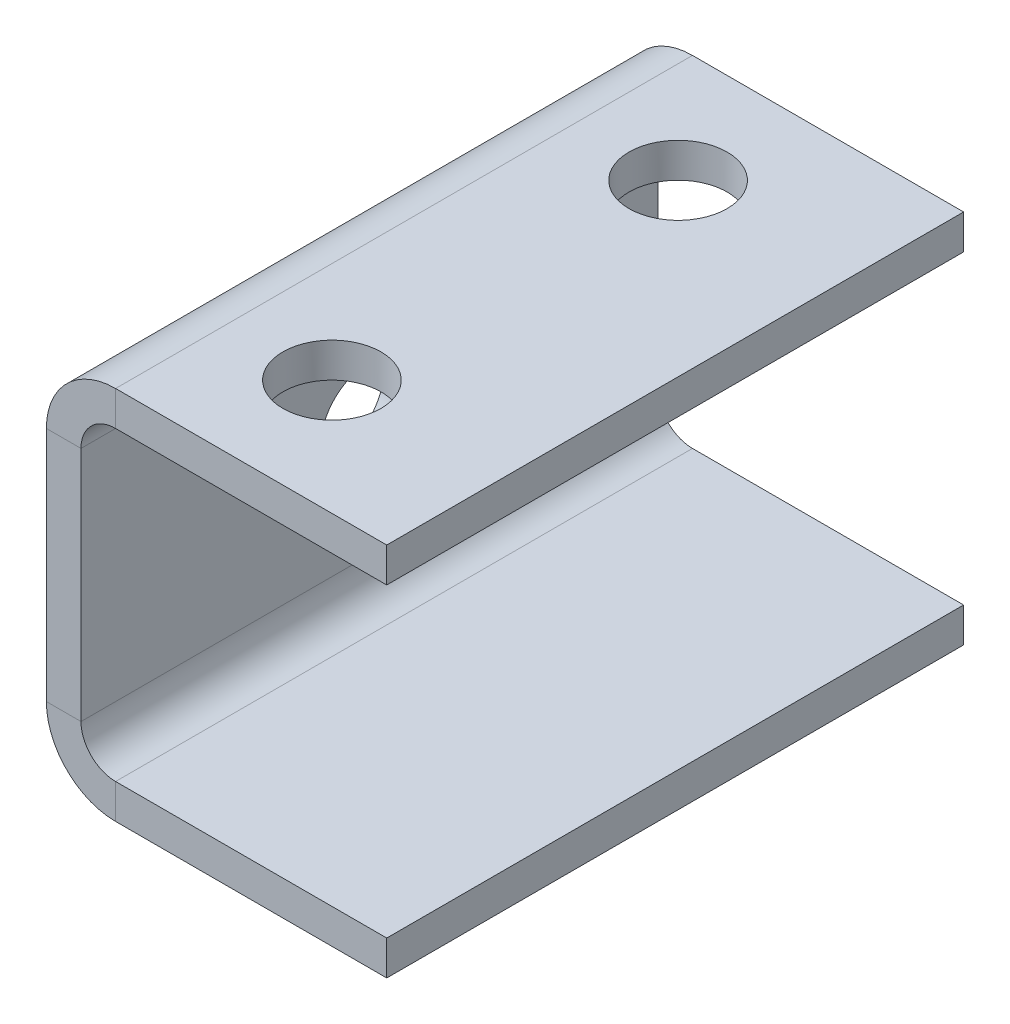
ISO-10303-21;
HEADER;
FILE_DESCRIPTION(('STEP AP214'),'2;1');
FILE_NAME('part.step','',(''),(''),'','','');
FILE_SCHEMA(('AUTOMOTIVE_DESIGN { 1 0 10303 214 1 1 1 1 }'));
ENDSEC;
DATA;
#1=APPLICATION_CONTEXT('core data for automotive mechanical design processes');
#2=APPLICATION_PROTOCOL_DEFINITION('international standard','automotive_design',2000,#1);
#3=PRODUCT_CONTEXT('',#1,'mechanical');
#4=PRODUCT('Part','Part','',(#3));
#5=PRODUCT_RELATED_PRODUCT_CATEGORY('part','',(#4));
#6=PRODUCT_DEFINITION_FORMATION('','',#4);
#7=PRODUCT_DEFINITION_CONTEXT('part definition',#1,'design');
#8=PRODUCT_DEFINITION('design','',#6,#7);
#9=PRODUCT_DEFINITION_SHAPE('','',#8);
#10=(LENGTH_UNIT() NAMED_UNIT(*) SI_UNIT(.MILLI.,.METRE.));
#11=(NAMED_UNIT(*) PLANE_ANGLE_UNIT() SI_UNIT($,.RADIAN.));
#12=(NAMED_UNIT(*) SI_UNIT($,.STERADIAN.) SOLID_ANGLE_UNIT());
#13=UNCERTAINTY_MEASURE_WITH_UNIT(LENGTH_MEASURE(1.E-05),#10,'distance_accuracy_value','');
#14=(GEOMETRIC_REPRESENTATION_CONTEXT(3) GLOBAL_UNCERTAINTY_ASSIGNED_CONTEXT((#13)) GLOBAL_UNIT_ASSIGNED_CONTEXT((#10,
#11,#12)) REPRESENTATION_CONTEXT('',''));
#15=CARTESIAN_POINT('',(0.,0.,0.));
#16=DIRECTION('',(0.,0.,1.));
#17=DIRECTION('',(1.,0.,0.));
#18=AXIS2_PLACEMENT_3D('',#15,#16,#17);
#19=CARTESIAN_POINT('',(6.00000000000001,-26.5,100.));
#20=DIRECTION('',(0.,0.,1.));
#21=DIRECTION('',(1.,0.,0.));
#22=AXIS2_PLACEMENT_3D('',#19,#20,#21);
#23=PLANE('',#22);
#24=DIRECTION('',(0.,-1.,0.));
#25=VECTOR('',#24,1.);
#26=CARTESIAN_POINT('',(6.00000000000001,-26.5,100.));
#27=LINE('',#26,#25);
#28=CARTESIAN_POINT('',(6.00000000000001,-26.5,100.));
#29=VERTEX_POINT('',#28);
#30=CARTESIAN_POINT('',(6.,-32.5,100.));
#31=VERTEX_POINT('',#30);
#32=EDGE_CURVE('E11',#29,#31,#27,.T.);
#33=ORIENTED_EDGE('',*,*,#32,.F.);
#34=CARTESIAN_POINT('',(6.00000000000001,-20.5,100.));
#35=DIRECTION('',(0.,0.,1.));
#36=DIRECTION('',(1.,0.,0.));
#37=AXIS2_PLACEMENT_3D('',#34,#35,#36);
#38=CIRCLE('',#37,6.);
#39=CARTESIAN_POINT('',(0.,-20.5,100.));
#40=VERTEX_POINT('',#39);
#41=EDGE_CURVE('E148',#29,#40,#38,.F.);
#42=ORIENTED_EDGE('',*,*,#41,.T.);
#43=DIRECTION('',(1.,0.,0.));
#44=VECTOR('',#43,1.);
#45=CARTESIAN_POINT('',(-5.99999999999999,-20.5,100.));
#46=LINE('',#45,#44);
#47=CARTESIAN_POINT('',(-5.99999999999999,-20.5,100.));
#48=VERTEX_POINT('',#47);
#49=EDGE_CURVE('E46',#48,#40,#46,.T.);
#50=ORIENTED_EDGE('',*,*,#49,.F.);
#51=CARTESIAN_POINT('',(6.00000000000001,-20.5,100.));
#52=DIRECTION('',(0.,0.,1.));
#53=DIRECTION('',(1.,0.,0.));
#54=AXIS2_PLACEMENT_3D('',#51,#52,#53);
#55=CIRCLE('',#54,12.);
#56=EDGE_CURVE('E243',#31,#48,#55,.F.);
#57=ORIENTED_EDGE('',*,*,#56,.F.);
#58=EDGE_LOOP('',(#33,#42,#50,#57));
#59=FACE_BOUND('',#58,.T.);
#60=ADVANCED_FACE('F38',(#59),#23,.T.);
#61=CARTESIAN_POINT('',(-5.99999999999999,-20.5,100.));
#62=DIRECTION('',(0.,0.,1.));
#63=DIRECTION('',(1.,0.,0.));
#64=AXIS2_PLACEMENT_3D('',#61,#62,#63);
#65=PLANE('',#64);
#66=DIRECTION('',(-1.,0.,0.));
#67=VECTOR('',#66,1.);
#68=CARTESIAN_POINT('',(0.,-26.5,100.));
#69=LINE('',#68,#67);
#70=CARTESIAN_POINT('',(53.,-26.5,100.));
#71=VERTEX_POINT('',#70);
#72=EDGE_CURVE('E153',#71,#29,#69,.T.);
#73=ORIENTED_EDGE('',*,*,#72,.T.);
#74=ORIENTED_EDGE('',*,*,#32,.T.);
#75=DIRECTION('',(1.,0.,0.));
#76=VECTOR('',#75,1.);
#77=CARTESIAN_POINT('',(0.,-32.5,100.));
#78=LINE('',#77,#76);
#79=CARTESIAN_POINT('',(53.,-32.5,100.));
#80=VERTEX_POINT('',#79);
#81=EDGE_CURVE('E256',#80,#31,#78,.F.);
#82=ORIENTED_EDGE('',*,*,#81,.F.);
#83=DIRECTION('',(0.,-1.,0.));
#84=VECTOR('',#83,1.);
#85=CARTESIAN_POINT('',(53.,-26.5,100.));
#86=LINE('',#85,#84);
#87=EDGE_CURVE('E258',#71,#80,#86,.T.);
#88=ORIENTED_EDGE('',*,*,#87,.F.);
#89=EDGE_LOOP('',(#73,#74,#82,#88));
#90=FACE_BOUND('',#89,.T.);
#91=ADVANCED_FACE('F269',(#90),#65,.T.);
#92=CARTESIAN_POINT('',(0.,-20.5,0.));
#93=DIRECTION('',(0.,0.,-1.));
#94=DIRECTION('',(-1.,0.,0.));
#95=AXIS2_PLACEMENT_3D('',#92,#93,#94);
#96=PLANE('',#95);
#97=DIRECTION('',(-1.,0.,0.));
#98=VECTOR('',#97,1.);
#99=CARTESIAN_POINT('',(0.,-20.5,0.));
#100=LINE('',#99,#98);
#101=CARTESIAN_POINT('',(0.,-20.5,0.));
#102=VERTEX_POINT('',#101);
#103=CARTESIAN_POINT('',(-5.99999999999999,-20.5,0.));
#104=VERTEX_POINT('',#103);
#105=EDGE_CURVE('E146',#102,#104,#100,.T.);
#106=ORIENTED_EDGE('',*,*,#105,.F.);
#107=CARTESIAN_POINT('',(6.00000000000001,-20.5,0.));
#108=DIRECTION('',(0.,0.,1.));
#109=DIRECTION('',(1.,0.,0.));
#110=AXIS2_PLACEMENT_3D('',#107,#108,#109);
#111=CIRCLE('',#110,6.);
#112=CARTESIAN_POINT('',(6.00000000000001,-26.5,0.));
#113=VERTEX_POINT('',#112);
#114=EDGE_CURVE('E160',#113,#102,#111,.F.);
#115=ORIENTED_EDGE('',*,*,#114,.F.);
#116=DIRECTION('',(0.,1.,0.));
#117=VECTOR('',#116,1.);
#118=CARTESIAN_POINT('',(6.,-32.5,0.));
#119=LINE('',#118,#117);
#120=CARTESIAN_POINT('',(6.,-32.5,0.));
#121=VERTEX_POINT('',#120);
#122=EDGE_CURVE('E234',#121,#113,#119,.T.);
#123=ORIENTED_EDGE('',*,*,#122,.F.);
#124=CARTESIAN_POINT('',(6.00000000000001,-20.5,0.));
#125=DIRECTION('',(0.,0.,1.));
#126=DIRECTION('',(1.,0.,0.));
#127=AXIS2_PLACEMENT_3D('',#124,#125,#126);
#128=CIRCLE('',#127,12.);
#129=EDGE_CURVE('E188',#121,#104,#128,.F.);
#130=ORIENTED_EDGE('',*,*,#129,.T.);
#131=EDGE_LOOP('',(#106,#115,#123,#130));
#132=FACE_BOUND('',#131,.T.);
#133=ADVANCED_FACE('F248',(#132),#96,.T.);
#134=CARTESIAN_POINT('',(6.,-32.5,0.));
#135=DIRECTION('',(0.,0.,-1.));
#136=DIRECTION('',(-1.,0.,0.));
#137=AXIS2_PLACEMENT_3D('',#134,#135,#136);
#138=PLANE('',#137);
#139=DIRECTION('',(0.,1.,0.));
#140=VECTOR('',#139,1.);
#141=CARTESIAN_POINT('',(0.,26.5,0.));
#142=LINE('',#141,#140);
#143=CARTESIAN_POINT('',(0.,20.5,0.));
#144=VERTEX_POINT('',#143);
#145=EDGE_CURVE('E201',#102,#144,#142,.T.);
#146=ORIENTED_EDGE('',*,*,#145,.F.);
#147=ORIENTED_EDGE('',*,*,#105,.T.);
#148=DIRECTION('',(0.,1.,0.));
#149=VECTOR('',#148,1.);
#150=CARTESIAN_POINT('',(-5.99999999999999,26.5,0.));
#151=LINE('',#150,#149);
#152=CARTESIAN_POINT('',(-5.99999999999999,20.5,0.));
#153=VERTEX_POINT('',#152);
#154=EDGE_CURVE('E186',#104,#153,#151,.T.);
#155=ORIENTED_EDGE('',*,*,#154,.T.);
#156=DIRECTION('',(1.,0.,0.));
#157=VECTOR('',#156,1.);
#158=CARTESIAN_POINT('',(-5.99999999999999,20.5,0.));
#159=LINE('',#158,#157);
#160=EDGE_CURVE('E95',#153,#144,#159,.T.);
#161=ORIENTED_EDGE('',*,*,#160,.T.);
#162=EDGE_LOOP('',(#146,#147,#155,#161));
#163=FACE_BOUND('',#162,.T.);
#164=ADVANCED_FACE('F236',(#163),#138,.T.);
#165=CARTESIAN_POINT('',(0.,20.5,100.));
#166=DIRECTION('',(0.,0.,1.));
#167=DIRECTION('',(1.,0.,0.));
#168=AXIS2_PLACEMENT_3D('',#165,#166,#167);
#169=PLANE('',#168);
#170=DIRECTION('',(-1.,0.,0.));
#171=VECTOR('',#170,1.);
#172=CARTESIAN_POINT('',(0.,20.5,100.));
#173=LINE('',#172,#171);
#174=CARTESIAN_POINT('',(0.,20.5,100.));
#175=VERTEX_POINT('',#174);
#176=CARTESIAN_POINT('',(-5.99999999999999,20.5,100.));
#177=VERTEX_POINT('',#176);
#178=EDGE_CURVE('E232',#175,#177,#173,.T.);
#179=ORIENTED_EDGE('',*,*,#178,.F.);
#180=CARTESIAN_POINT('',(6.00000000000001,20.5,100.));
#181=DIRECTION('',(0.,0.,1.));
#182=DIRECTION('',(1.,0.,0.));
#183=AXIS2_PLACEMENT_3D('',#180,#181,#182);
#184=CIRCLE('',#183,6.);
#185=CARTESIAN_POINT('',(6.00000000000001,26.5,100.));
#186=VERTEX_POINT('',#185);
#187=EDGE_CURVE('E168',#175,#186,#184,.F.);
#188=ORIENTED_EDGE('',*,*,#187,.T.);
#189=DIRECTION('',(0.,-1.,0.));
#190=VECTOR('',#189,1.);
#191=CARTESIAN_POINT('',(6.00000000000001,32.5,100.));
#192=LINE('',#191,#190);
#193=CARTESIAN_POINT('',(6.00000000000001,32.5,100.));
#194=VERTEX_POINT('',#193);
#195=EDGE_CURVE('E54',#194,#186,#192,.T.);
#196=ORIENTED_EDGE('',*,*,#195,.F.);
#197=CARTESIAN_POINT('',(6.00000000000001,20.5,100.));
#198=DIRECTION('',(0.,0.,1.));
#199=DIRECTION('',(1.,0.,0.));
#200=AXIS2_PLACEMENT_3D('',#197,#198,#199);
#201=CIRCLE('',#200,12.);
#202=EDGE_CURVE('E260',#177,#194,#201,.F.);
#203=ORIENTED_EDGE('',*,*,#202,.F.);
#204=EDGE_LOOP('',(#179,#188,#196,#203));
#205=FACE_BOUND('',#204,.T.);
#206=ADVANCED_FACE('F295',(#205),#169,.T.);
#207=CARTESIAN_POINT('',(6.00000000000001,32.5,100.));
#208=DIRECTION('',(0.,0.,1.));
#209=DIRECTION('',(1.,0.,0.));
#210=AXIS2_PLACEMENT_3D('',#207,#208,#209);
#211=PLANE('',#210);
#212=DIRECTION('',(0.,1.,0.));
#213=VECTOR('',#212,1.);
#214=CARTESIAN_POINT('',(0.,26.5,100.));
#215=LINE('',#214,#213);
#216=EDGE_CURVE('E138',#40,#175,#215,.T.);
#217=ORIENTED_EDGE('',*,*,#216,.T.);
#218=ORIENTED_EDGE('',*,*,#178,.T.);
#219=DIRECTION('',(0.,1.,0.));
#220=VECTOR('',#219,1.);
#221=CARTESIAN_POINT('',(-5.99999999999999,26.5,100.));
#222=LINE('',#221,#220);
#223=EDGE_CURVE('E141',#48,#177,#222,.T.);
#224=ORIENTED_EDGE('',*,*,#223,.F.);
#225=ORIENTED_EDGE('',*,*,#49,.T.);
#226=EDGE_LOOP('',(#217,#218,#224,#225));
#227=FACE_BOUND('',#226,.T.);
#228=ADVANCED_FACE('F136',(#227),#211,.T.);
#229=CARTESIAN_POINT('',(6.00000000000001,26.5,0.));
#230=DIRECTION('',(0.,0.,-1.));
#231=DIRECTION('',(-1.,0.,0.));
#232=AXIS2_PLACEMENT_3D('',#229,#230,#231);
#233=PLANE('',#232);
#234=DIRECTION('',(0.,1.,0.));
#235=VECTOR('',#234,1.);
#236=CARTESIAN_POINT('',(6.00000000000001,26.5,0.));
#237=LINE('',#236,#235);
#238=CARTESIAN_POINT('',(6.00000000000001,26.5,0.));
#239=VERTEX_POINT('',#238);
#240=CARTESIAN_POINT('',(6.00000000000001,32.5,0.));
#241=VERTEX_POINT('',#240);
#242=EDGE_CURVE('E102',#239,#241,#237,.T.);
#243=ORIENTED_EDGE('',*,*,#242,.F.);
#244=CARTESIAN_POINT('',(6.00000000000001,20.5,0.));
#245=DIRECTION('',(0.,0.,1.));
#246=DIRECTION('',(1.,0.,0.));
#247=AXIS2_PLACEMENT_3D('',#244,#245,#246);
#248=CIRCLE('',#247,6.);
#249=EDGE_CURVE('E203',#144,#239,#248,.F.);
#250=ORIENTED_EDGE('',*,*,#249,.F.);
#251=ORIENTED_EDGE('',*,*,#160,.F.);
#252=CARTESIAN_POINT('',(6.00000000000001,20.5,0.));
#253=DIRECTION('',(0.,0.,1.));
#254=DIRECTION('',(1.,0.,0.));
#255=AXIS2_PLACEMENT_3D('',#252,#253,#254);
#256=CIRCLE('',#255,12.);
#257=EDGE_CURVE('E184',#153,#241,#256,.F.);
#258=ORIENTED_EDGE('',*,*,#257,.T.);
#259=EDGE_LOOP('',(#243,#250,#251,#258));
#260=FACE_BOUND('',#259,.T.);
#261=ADVANCED_FACE('F301',(#260),#233,.T.);
#262=CARTESIAN_POINT('',(-5.99999999999999,20.5,0.));
#263=DIRECTION('',(0.,0.,-1.));
#264=DIRECTION('',(-1.,0.,0.));
#265=AXIS2_PLACEMENT_3D('',#262,#263,#264);
#266=PLANE('',#265);
#267=DIRECTION('',(1.,0.,0.));
#268=VECTOR('',#267,1.);
#269=CARTESIAN_POINT('',(0.,26.5,0.));
#270=LINE('',#269,#268);
#271=CARTESIAN_POINT('',(53.,26.5,0.));
#272=VERTEX_POINT('',#271);
#273=EDGE_CURVE('E174',#239,#272,#270,.T.);
#274=ORIENTED_EDGE('',*,*,#273,.F.);
#275=ORIENTED_EDGE('',*,*,#242,.T.);
#276=DIRECTION('',(1.,0.,0.));
#277=VECTOR('',#276,1.);
#278=CARTESIAN_POINT('',(0.,32.5,0.));
#279=LINE('',#278,#277);
#280=CARTESIAN_POINT('',(53.,32.5,0.));
#281=VERTEX_POINT('',#280);
#282=EDGE_CURVE('E181',#241,#281,#279,.T.);
#283=ORIENTED_EDGE('',*,*,#282,.T.);
#284=DIRECTION('',(0.,-1.,0.));
#285=VECTOR('',#284,1.);
#286=CARTESIAN_POINT('',(53.,32.5,0.));
#287=LINE('',#286,#285);
#288=EDGE_CURVE('E177',#281,#272,#287,.T.);
#289=ORIENTED_EDGE('',*,*,#288,.T.);
#290=EDGE_LOOP('',(#274,#275,#283,#289));
#291=FACE_BOUND('',#290,.T.);
#292=ADVANCED_FACE('F304',(#291),#266,.T.);
#293=CARTESIAN_POINT('',(0.,26.5,100.));
#294=DIRECTION('',(0.,1.,0.));
#295=DIRECTION('',(0.,0.,1.));
#296=AXIS2_PLACEMENT_3D('',#293,#294,#295);
#297=PLANE('',#296);
#298=CARTESIAN_POINT('',(23.5,26.5,80.));
#299=DIRECTION('',(0.,1.,0.));
#300=DIRECTION('',(0.,0.,1.));
#301=AXIS2_PLACEMENT_3D('',#298,#299,#300);
#302=CIRCLE('',#301,8.50000000000004);
#303=CARTESIAN_POINT('',(23.5,26.5,88.5));
#304=VERTEX_POINT('',#303);
#305=EDGE_CURVE('E559',#304,#304,#302,.T.);
#306=ORIENTED_EDGE('',*,*,#305,.T.);
#307=EDGE_LOOP('',(#306));
#308=FACE_BOUND('',#307,.T.);
#309=CARTESIAN_POINT('',(23.5,26.5,20.));
#310=DIRECTION('',(0.,1.,0.));
#311=DIRECTION('',(0.,0.,1.));
#312=AXIS2_PLACEMENT_3D('',#309,#310,#311);
#313=CIRCLE('',#312,8.5);
#314=CARTESIAN_POINT('',(23.5,26.5,28.5));
#315=VERTEX_POINT('',#314);
#316=EDGE_CURVE('E178',#315,#315,#313,.T.);
#317=ORIENTED_EDGE('',*,*,#316,.T.);
#318=EDGE_LOOP('',(#317));
#319=FACE_BOUND('',#318,.T.);
#320=ORIENTED_EDGE('',*,*,#273,.T.);
#321=DIRECTION('',(0.,0.,-1.));
#322=VECTOR('',#321,1.);
#323=CARTESIAN_POINT('',(53.,26.5,100.));
#324=LINE('',#323,#322);
#325=CARTESIAN_POINT('',(53.,26.5,100.));
#326=VERTEX_POINT('',#325);
#327=EDGE_CURVE('E227',#326,#272,#324,.T.);
#328=ORIENTED_EDGE('',*,*,#327,.F.);
#329=DIRECTION('',(1.,0.,0.));
#330=VECTOR('',#329,1.);
#331=CARTESIAN_POINT('',(0.,26.5,100.));
#332=LINE('',#331,#330);
#333=EDGE_CURVE('E108',#186,#326,#332,.T.);
#334=ORIENTED_EDGE('',*,*,#333,.F.);
#335=DIRECTION('',(0.,0.,-1.));
#336=VECTOR('',#335,1.);
#337=CARTESIAN_POINT('',(6.00000000000001,26.5,100.));
#338=LINE('',#337,#336);
#339=EDGE_CURVE('E170',#186,#239,#338,.T.);
#340=ORIENTED_EDGE('',*,*,#339,.T.);
#341=EDGE_LOOP('',(#320,#328,#334,#340));
#342=FACE_BOUND('',#341,.T.);
#343=ADVANCED_FACE('F307',(#308,#319,#342),#297,.F.);
#344=CARTESIAN_POINT('',(53.,32.5,100.));
#345=DIRECTION('',(1.,0.,0.));
#346=DIRECTION('',(0.,0.,-1.));
#347=AXIS2_PLACEMENT_3D('',#344,#345,#346);
#348=PLANE('',#347);
#349=ORIENTED_EDGE('',*,*,#288,.F.);
#350=DIRECTION('',(0.,0.,-1.));
#351=VECTOR('',#350,1.);
#352=CARTESIAN_POINT('',(53.,32.5,100.));
#353=LINE('',#352,#351);
#354=CARTESIAN_POINT('',(53.,32.5,100.));
#355=VERTEX_POINT('',#354);
#356=EDGE_CURVE('E225',#355,#281,#353,.T.);
#357=ORIENTED_EDGE('',*,*,#356,.F.);
#358=DIRECTION('',(0.,-1.,0.));
#359=VECTOR('',#358,1.);
#360=CARTESIAN_POINT('',(53.,32.5,100.));
#361=LINE('',#360,#359);
#362=EDGE_CURVE('E570',#355,#326,#361,.T.);
#363=ORIENTED_EDGE('',*,*,#362,.T.);
#364=ORIENTED_EDGE('',*,*,#327,.T.);
#365=EDGE_LOOP('',(#349,#357,#363,#364));
#366=FACE_BOUND('',#365,.T.);
#367=ADVANCED_FACE('F311',(#366),#348,.T.);
#368=CARTESIAN_POINT('',(0.,32.5,100.));
#369=DIRECTION('',(0.,1.,0.));
#370=DIRECTION('',(0.,0.,1.));
#371=AXIS2_PLACEMENT_3D('',#368,#369,#370);
#372=PLANE('',#371);
#373=CARTESIAN_POINT('',(23.5,32.5,80.));
#374=DIRECTION('',(0.,-1.,0.));
#375=DIRECTION('',(0.,0.,-1.));
#376=AXIS2_PLACEMENT_3D('',#373,#374,#375);
#377=CIRCLE('',#376,8.50000000000004);
#378=CARTESIAN_POINT('',(23.5,32.5,71.5));
#379=VERTEX_POINT('',#378);
#380=EDGE_CURVE('E556',#379,#379,#377,.T.);
#381=ORIENTED_EDGE('',*,*,#380,.T.);
#382=EDGE_LOOP('',(#381));
#383=FACE_BOUND('',#382,.T.);
#384=CARTESIAN_POINT('',(23.5,32.5,20.));
#385=DIRECTION('',(0.,-1.,0.));
#386=DIRECTION('',(0.,0.,-1.));
#387=AXIS2_PLACEMENT_3D('',#384,#385,#386);
#388=CIRCLE('',#387,8.5);
#389=CARTESIAN_POINT('',(23.5,32.5,11.5));
#390=VERTEX_POINT('',#389);
#391=EDGE_CURVE('E562',#390,#390,#388,.T.);
#392=ORIENTED_EDGE('',*,*,#391,.T.);
#393=EDGE_LOOP('',(#392));
#394=FACE_BOUND('',#393,.T.);
#395=ORIENTED_EDGE('',*,*,#282,.F.);
#396=DIRECTION('',(0.,0.,-1.));
#397=VECTOR('',#396,1.);
#398=CARTESIAN_POINT('',(6.00000000000001,32.5,100.));
#399=LINE('',#398,#397);
#400=EDGE_CURVE('E222',#194,#241,#399,.T.);
#401=ORIENTED_EDGE('',*,*,#400,.F.);
#402=DIRECTION('',(1.,0.,0.));
#403=VECTOR('',#402,1.);
#404=CARTESIAN_POINT('',(0.,32.5,100.));
#405=LINE('',#404,#403);
#406=EDGE_CURVE('E573',#194,#355,#405,.T.);
#407=ORIENTED_EDGE('',*,*,#406,.T.);
#408=ORIENTED_EDGE('',*,*,#356,.T.);
#409=EDGE_LOOP('',(#395,#401,#407,#408));
#410=FACE_BOUND('',#409,.T.);
#411=ADVANCED_FACE('F315',(#383,#394,#410),#372,.T.);
#412=CARTESIAN_POINT('',(6.00000000000001,20.5,100.));
#413=DIRECTION('',(0.,0.,-1.));
#414=DIRECTION('',(-1.,0.,0.));
#415=AXIS2_PLACEMENT_3D('',#412,#413,#414);
#416=CYLINDRICAL_SURFACE('',#415,12.);
#417=ORIENTED_EDGE('',*,*,#257,.F.);
#418=DIRECTION('',(0.,0.,-1.));
#419=VECTOR('',#418,1.);
#420=CARTESIAN_POINT('',(-5.99999999999999,20.5,100.));
#421=LINE('',#420,#419);
#422=EDGE_CURVE('E219',#177,#153,#421,.T.);
#423=ORIENTED_EDGE('',*,*,#422,.F.);
#424=ORIENTED_EDGE('',*,*,#202,.T.);
#425=ORIENTED_EDGE('',*,*,#400,.T.);
#426=EDGE_LOOP('',(#417,#423,#424,#425));
#427=FACE_BOUND('',#426,.T.);
#428=ADVANCED_FACE('F319',(#427),#416,.T.);
#429=CARTESIAN_POINT('',(-5.99999999999999,26.5,100.));
#430=DIRECTION('',(-1.,0.,0.));
#431=DIRECTION('',(0.,0.,1.));
#432=AXIS2_PLACEMENT_3D('',#429,#430,#431);
#433=PLANE('',#432);
#434=CARTESIAN_POINT('',(-5.99999999999999,0.,50.));
#435=DIRECTION('',(1.,0.,0.));
#436=DIRECTION('',(0.,0.,-1.));
#437=AXIS2_PLACEMENT_3D('',#434,#435,#436);
#438=CIRCLE('',#437,8.50000000000001);
#439=CARTESIAN_POINT('',(-5.99999999999999,0.,41.5));
#440=VERTEX_POINT('',#439);
#441=EDGE_CURVE('E551',#440,#440,#438,.T.);
#442=ORIENTED_EDGE('',*,*,#441,.T.);
#443=EDGE_LOOP('',(#442));
#444=FACE_BOUND('',#443,.T.);
#445=ORIENTED_EDGE('',*,*,#154,.F.);
#446=DIRECTION('',(0.,0.,-1.));
#447=VECTOR('',#446,1.);
#448=CARTESIAN_POINT('',(-5.99999999999999,-20.5,100.));
#449=LINE('',#448,#447);
#450=EDGE_CURVE('E216',#48,#104,#449,.T.);
#451=ORIENTED_EDGE('',*,*,#450,.F.);
#452=ORIENTED_EDGE('',*,*,#223,.T.);
#453=ORIENTED_EDGE('',*,*,#422,.T.);
#454=EDGE_LOOP('',(#445,#451,#452,#453));
#455=FACE_BOUND('',#454,.T.);
#456=ADVANCED_FACE('F245',(#444,#455),#433,.T.);
#457=CARTESIAN_POINT('',(6.00000000000001,-20.5,100.));
#458=DIRECTION('',(0.,0.,-1.));
#459=DIRECTION('',(-1.,0.,0.));
#460=AXIS2_PLACEMENT_3D('',#457,#458,#459);
#461=CYLINDRICAL_SURFACE('',#460,12.);
#462=ORIENTED_EDGE('',*,*,#129,.F.);
#463=DIRECTION('',(0.,0.,-1.));
#464=VECTOR('',#463,1.);
#465=CARTESIAN_POINT('',(6.,-32.5,100.));
#466=LINE('',#465,#464);
#467=EDGE_CURVE('E213',#31,#121,#466,.T.);
#468=ORIENTED_EDGE('',*,*,#467,.F.);
#469=ORIENTED_EDGE('',*,*,#56,.T.);
#470=ORIENTED_EDGE('',*,*,#450,.T.);
#471=EDGE_LOOP('',(#462,#468,#469,#470));
#472=FACE_BOUND('',#471,.T.);
#473=ADVANCED_FACE('F241',(#472),#461,.T.);
#474=CARTESIAN_POINT('',(0.,-32.5,100.));
#475=DIRECTION('',(0.,-1.,0.));
#476=DIRECTION('',(0.,0.,-1.));
#477=AXIS2_PLACEMENT_3D('',#474,#475,#476);
#478=PLANE('',#477);
#479=DIRECTION('',(1.,0.,0.));
#480=VECTOR('',#479,1.);
#481=CARTESIAN_POINT('',(0.,-32.5,0.));
#482=LINE('',#481,#480);
#483=CARTESIAN_POINT('',(53.,-32.5,0.));
#484=VERTEX_POINT('',#483);
#485=EDGE_CURVE('E191',#484,#121,#482,.F.);
#486=ORIENTED_EDGE('',*,*,#485,.F.);
#487=DIRECTION('',(0.,0.,-1.));
#488=VECTOR('',#487,1.);
#489=CARTESIAN_POINT('',(53.,-32.5,100.));
#490=LINE('',#489,#488);
#491=EDGE_CURVE('E211',#80,#484,#490,.T.);
#492=ORIENTED_EDGE('',*,*,#491,.F.);
#493=ORIENTED_EDGE('',*,*,#81,.T.);
#494=ORIENTED_EDGE('',*,*,#467,.T.);
#495=EDGE_LOOP('',(#486,#492,#493,#494));
#496=FACE_BOUND('',#495,.T.);
#497=ADVANCED_FACE('F254',(#496),#478,.T.);
#498=CARTESIAN_POINT('',(53.,-26.5,100.));
#499=DIRECTION('',(1.,0.,0.));
#500=DIRECTION('',(0.,0.,-1.));
#501=AXIS2_PLACEMENT_3D('',#498,#499,#500);
#502=PLANE('',#501);
#503=DIRECTION('',(0.,-1.,0.));
#504=VECTOR('',#503,1.);
#505=CARTESIAN_POINT('',(53.,-26.5,0.));
#506=LINE('',#505,#504);
#507=CARTESIAN_POINT('',(53.,-26.5,0.));
#508=VERTEX_POINT('',#507);
#509=EDGE_CURVE('E194',#508,#484,#506,.T.);
#510=ORIENTED_EDGE('',*,*,#509,.F.);
#511=DIRECTION('',(0.,0.,-1.));
#512=VECTOR('',#511,1.);
#513=CARTESIAN_POINT('',(53.,-26.5,100.));
#514=LINE('',#513,#512);
#515=EDGE_CURVE('E209',#71,#508,#514,.T.);
#516=ORIENTED_EDGE('',*,*,#515,.F.);
#517=ORIENTED_EDGE('',*,*,#87,.T.);
#518=ORIENTED_EDGE('',*,*,#491,.T.);
#519=EDGE_LOOP('',(#510,#516,#517,#518));
#520=FACE_BOUND('',#519,.T.);
#521=ADVANCED_FACE('F275',(#520),#502,.T.);
#522=CARTESIAN_POINT('',(0.,-26.5,100.));
#523=DIRECTION('',(0.,-1.,0.));
#524=DIRECTION('',(0.,0.,-1.));
#525=AXIS2_PLACEMENT_3D('',#522,#523,#524);
#526=PLANE('',#525);
#527=DIRECTION('',(-1.,0.,0.));
#528=VECTOR('',#527,1.);
#529=CARTESIAN_POINT('',(0.,-26.5,0.));
#530=LINE('',#529,#528);
#531=EDGE_CURVE('E197',#508,#113,#530,.T.);
#532=ORIENTED_EDGE('',*,*,#531,.T.);
#533=DIRECTION('',(0.,0.,-1.));
#534=VECTOR('',#533,1.);
#535=CARTESIAN_POINT('',(6.00000000000001,-26.5,100.));
#536=LINE('',#535,#534);
#537=EDGE_CURVE('E162',#29,#113,#536,.T.);
#538=ORIENTED_EDGE('',*,*,#537,.F.);
#539=ORIENTED_EDGE('',*,*,#72,.F.);
#540=ORIENTED_EDGE('',*,*,#515,.T.);
#541=EDGE_LOOP('',(#532,#538,#539,#540));
#542=FACE_BOUND('',#541,.T.);
#543=ADVANCED_FACE('F271',(#542),#526,.F.);
#544=CARTESIAN_POINT('',(6.00000000000001,-20.5,100.));
#545=DIRECTION('',(0.,0.,-1.));
#546=DIRECTION('',(-1.,0.,0.));
#547=AXIS2_PLACEMENT_3D('',#544,#545,#546);
#548=CYLINDRICAL_SURFACE('',#547,6.);
#549=ORIENTED_EDGE('',*,*,#114,.T.);
#550=DIRECTION('',(0.,0.,-1.));
#551=VECTOR('',#550,1.);
#552=CARTESIAN_POINT('',(0.,-20.5,100.));
#553=LINE('',#552,#551);
#554=EDGE_CURVE('E157',#40,#102,#553,.T.);
#555=ORIENTED_EDGE('',*,*,#554,.F.);
#556=ORIENTED_EDGE('',*,*,#41,.F.);
#557=ORIENTED_EDGE('',*,*,#537,.T.);
#558=EDGE_LOOP('',(#549,#555,#556,#557));
#559=FACE_BOUND('',#558,.T.);
#560=ADVANCED_FACE('F158',(#559),#548,.F.);
#561=CARTESIAN_POINT('',(0.,26.5,100.));
#562=DIRECTION('',(-1.,0.,0.));
#563=DIRECTION('',(0.,0.,1.));
#564=AXIS2_PLACEMENT_3D('',#561,#562,#563);
#565=PLANE('',#564);
#566=CARTESIAN_POINT('',(0.,0.,50.));
#567=DIRECTION('',(-1.,0.,0.));
#568=DIRECTION('',(0.,0.,1.));
#569=AXIS2_PLACEMENT_3D('',#566,#567,#568);
#570=CIRCLE('',#569,8.50000000000001);
#571=CARTESIAN_POINT('',(0.,0.,58.5));
#572=VERTEX_POINT('',#571);
#573=EDGE_CURVE('E554',#572,#572,#570,.T.);
#574=ORIENTED_EDGE('',*,*,#573,.T.);
#575=EDGE_LOOP('',(#574));
#576=FACE_BOUND('',#575,.T.);
#577=ORIENTED_EDGE('',*,*,#145,.T.);
#578=DIRECTION('',(0.,0.,-1.));
#579=VECTOR('',#578,1.);
#580=CARTESIAN_POINT('',(0.,20.5,100.));
#581=LINE('',#580,#579);
#582=EDGE_CURVE('E163',#175,#144,#581,.T.);
#583=ORIENTED_EDGE('',*,*,#582,.F.);
#584=ORIENTED_EDGE('',*,*,#216,.F.);
#585=ORIENTED_EDGE('',*,*,#554,.T.);
#586=EDGE_LOOP('',(#577,#583,#584,#585));
#587=FACE_BOUND('',#586,.T.);
#588=ADVANCED_FACE('F165',(#576,#587),#565,.F.);
#589=CARTESIAN_POINT('',(6.00000000000001,20.5,100.));
#590=DIRECTION('',(0.,0.,-1.));
#591=DIRECTION('',(-1.,0.,0.));
#592=AXIS2_PLACEMENT_3D('',#589,#590,#591);
#593=CYLINDRICAL_SURFACE('',#592,6.);
#594=ORIENTED_EDGE('',*,*,#249,.T.);
#595=ORIENTED_EDGE('',*,*,#339,.F.);
#596=ORIENTED_EDGE('',*,*,#187,.F.);
#597=ORIENTED_EDGE('',*,*,#582,.T.);
#598=EDGE_LOOP('',(#594,#595,#596,#597));
#599=FACE_BOUND('',#598,.T.);
#600=ADVANCED_FACE('F366',(#599),#593,.F.);
#601=CARTESIAN_POINT('',(6.00000000000001,20.5,100.));
#602=DIRECTION('',(0.,0.,1.));
#603=DIRECTION('',(1.,0.,0.));
#604=AXIS2_PLACEMENT_3D('',#601,#602,#603);
#605=PLANE('',#604);
#606=ORIENTED_EDGE('',*,*,#333,.T.);
#607=ORIENTED_EDGE('',*,*,#362,.F.);
#608=ORIENTED_EDGE('',*,*,#406,.F.);
#609=ORIENTED_EDGE('',*,*,#195,.T.);
#610=EDGE_LOOP('',(#606,#607,#608,#609));
#611=FACE_BOUND('',#610,.T.);
#612=ADVANCED_FACE('F371',(#611),#605,.T.);
#613=CARTESIAN_POINT('',(6.00000000000001,20.5,0.));
#614=DIRECTION('',(0.,0.,1.));
#615=DIRECTION('',(1.,0.,0.));
#616=AXIS2_PLACEMENT_3D('',#613,#614,#615);
#617=PLANE('',#616);
#618=ORIENTED_EDGE('',*,*,#485,.T.);
#619=ORIENTED_EDGE('',*,*,#122,.T.);
#620=ORIENTED_EDGE('',*,*,#531,.F.);
#621=ORIENTED_EDGE('',*,*,#509,.T.);
#622=EDGE_LOOP('',(#618,#619,#620,#621));
#623=FACE_BOUND('',#622,.T.);
#624=ADVANCED_FACE('F273',(#623),#617,.F.);
#625=CARTESIAN_POINT('',(23.5,-32.501,20.));
#626=DIRECTION('',(0.,1.,0.));
#627=DIRECTION('',(0.,0.,1.));
#628=AXIS2_PLACEMENT_3D('',#625,#626,#627);
#629=CYLINDRICAL_SURFACE('',#628,8.5);
#630=ORIENTED_EDGE('',*,*,#391,.F.);
#631=EDGE_LOOP('',(#630));
#632=FACE_BOUND('',#631,.T.);
#633=ORIENTED_EDGE('',*,*,#316,.F.);
#634=EDGE_LOOP('',(#633));
#635=FACE_BOUND('',#634,.T.);
#636=ADVANCED_FACE('F391',(#632,#635),#629,.F.);
#637=CARTESIAN_POINT('',(23.5,-32.501,80.));
#638=DIRECTION('',(0.,1.,0.));
#639=DIRECTION('',(0.,0.,1.));
#640=AXIS2_PLACEMENT_3D('',#637,#638,#639);
#641=CYLINDRICAL_SURFACE('',#640,8.50000000000004);
#642=ORIENTED_EDGE('',*,*,#380,.F.);
#643=EDGE_LOOP('',(#642));
#644=FACE_BOUND('',#643,.T.);
#645=ORIENTED_EDGE('',*,*,#305,.F.);
#646=EDGE_LOOP('',(#645));
#647=FACE_BOUND('',#646,.T.);
#648=ADVANCED_FACE('F418',(#644,#647),#641,.F.);
#649=CARTESIAN_POINT('',(53.001,0.,50.));
#650=DIRECTION('',(-1.,0.,0.));
#651=DIRECTION('',(0.,0.,1.));
#652=AXIS2_PLACEMENT_3D('',#649,#650,#651);
#653=CYLINDRICAL_SURFACE('',#652,8.50000000000001);
#654=ORIENTED_EDGE('',*,*,#441,.F.);
#655=EDGE_LOOP('',(#654));
#656=FACE_BOUND('',#655,.T.);
#657=ORIENTED_EDGE('',*,*,#573,.F.);
#658=EDGE_LOOP('',(#657));
#659=FACE_BOUND('',#658,.T.);
#660=ADVANCED_FACE('F428',(#656,#659),#653,.F.);
#661=CLOSED_SHELL('',(#60,#91,#133,#164,#206,#228,#261,#292,#343,#367,#411,#428,#456,#473,#497,
#521,#543,#560,#588,#600,#612,#624,#636,#648,#660));
#662=MANIFOLD_SOLID_BREP('B2',#661);
#663=ADVANCED_BREP_SHAPE_REPRESENTATION('',(#18,#662),#14);
#664=SHAPE_DEFINITION_REPRESENTATION(#9,#663);
ENDSEC;
END-ISO-10303-21;
